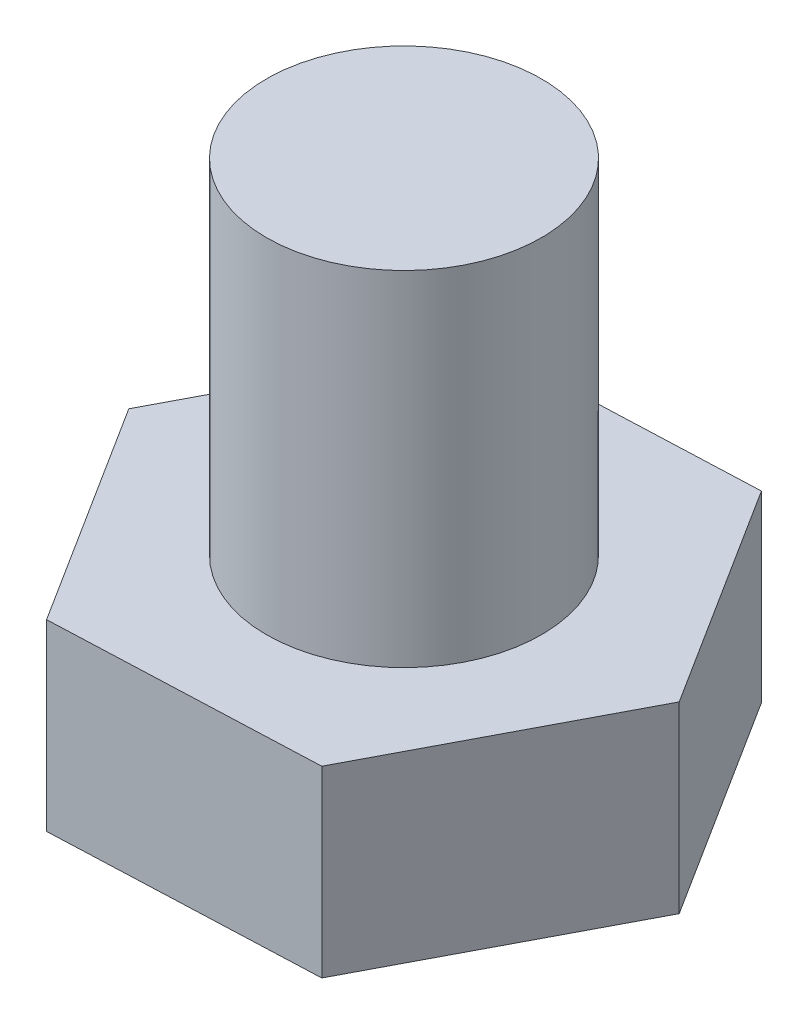
ISO-10303-21;
HEADER;
FILE_DESCRIPTION(('STEP AP214'),'2;1');
FILE_NAME('part.step','',(''),(''),'','','');
FILE_SCHEMA(('AUTOMOTIVE_DESIGN { 1 0 10303 214 1 1 1 1 }'));
ENDSEC;
DATA;
#1=APPLICATION_CONTEXT('core data for automotive mechanical design processes');
#2=APPLICATION_PROTOCOL_DEFINITION('international standard','automotive_design',2000,#1);
#3=PRODUCT_CONTEXT('',#1,'mechanical');
#4=PRODUCT('Part','Part','',(#3));
#5=PRODUCT_RELATED_PRODUCT_CATEGORY('part','',(#4));
#6=PRODUCT_DEFINITION_FORMATION('','',#4);
#7=PRODUCT_DEFINITION_CONTEXT('part definition',#1,'design');
#8=PRODUCT_DEFINITION('design','',#6,#7);
#9=PRODUCT_DEFINITION_SHAPE('','',#8);
#10=(LENGTH_UNIT() NAMED_UNIT(*) SI_UNIT(.MILLI.,.METRE.));
#11=(NAMED_UNIT(*) PLANE_ANGLE_UNIT() SI_UNIT($,.RADIAN.));
#12=(NAMED_UNIT(*) SI_UNIT($,.STERADIAN.) SOLID_ANGLE_UNIT());
#13=UNCERTAINTY_MEASURE_WITH_UNIT(LENGTH_MEASURE(1.E-05),#10,'distance_accuracy_value','');
#14=(GEOMETRIC_REPRESENTATION_CONTEXT(3) GLOBAL_UNCERTAINTY_ASSIGNED_CONTEXT((#13)) GLOBAL_UNIT_ASSIGNED_CONTEXT((#10,
#11,#12)) REPRESENTATION_CONTEXT('',''));
#15=CARTESIAN_POINT('',(0.,0.,0.));
#16=DIRECTION('',(0.,0.,1.));
#17=DIRECTION('',(1.,0.,0.));
#18=AXIS2_PLACEMENT_3D('',#15,#16,#17);
#19=CARTESIAN_POINT('',(11.5376018604348,8.,-0.465914845680283));
#20=DIRECTION('',(-0.845145434914637,0.,0.534536428920377));
#21=DIRECTION('',(0.534536428920377,0.,0.845145434914637));
#22=AXIS2_PLACEMENT_3D('',#19,#20,#21);
#23=PLANE('',#22);
#24=DIRECTION('',(-0.534536428920377,0.,-0.845145434914637));
#25=VECTOR('',#24,1.);
#26=CARTESIAN_POINT('',(11.5376018604348,0.,-0.465914845680283));
#27=LINE('',#26,#25);
#28=CARTESIAN_POINT('',(11.5376018604348,0.,-0.465914845680283));
#29=VERTEX_POINT('',#28);
#30=CARTESIAN_POINT('',(5.36530683785796,0.,-10.2248137327273));
#31=VERTEX_POINT('',#30);
#32=EDGE_CURVE('E119',#29,#31,#27,.T.);
#33=ORIENTED_EDGE('',*,*,#32,.T.);
#34=DIRECTION('',(0.,-1.,0.));
#35=VECTOR('',#34,1.);
#36=CARTESIAN_POINT('',(5.36530683785796,8.,-10.2248137327273));
#37=LINE('',#36,#35);
#38=CARTESIAN_POINT('',(5.36530683785796,8.,-10.2248137327273));
#39=VERTEX_POINT('',#38);
#40=EDGE_CURVE('E36',#39,#31,#37,.T.);
#41=ORIENTED_EDGE('',*,*,#40,.F.);
#42=DIRECTION('',(-0.534536428920377,0.,-0.845145434914637));
#43=VECTOR('',#42,1.);
#44=CARTESIAN_POINT('',(11.5376018604348,8.,-0.465914845680283));
#45=LINE('',#44,#43);
#46=CARTESIAN_POINT('',(11.5376018604348,8.,-0.465914845680283));
#47=VERTEX_POINT('',#46);
#48=EDGE_CURVE('E130',#47,#39,#45,.T.);
#49=ORIENTED_EDGE('',*,*,#48,.F.);
#50=DIRECTION('',(0.,-1.,0.));
#51=VECTOR('',#50,1.);
#52=CARTESIAN_POINT('',(11.5376018604348,8.,-0.465914845680283));
#53=LINE('',#52,#51);
#54=EDGE_CURVE('E115',#47,#29,#53,.T.);
#55=ORIENTED_EDGE('',*,*,#54,.T.);
#56=EDGE_LOOP('',(#33,#41,#49,#55));
#57=FACE_BOUND('',#56,.T.);
#58=ADVANCED_FACE('F33',(#57),#23,.F.);
#59=CARTESIAN_POINT('',(5.36530683785796,8.,-10.2248137327273));
#60=DIRECTION('',(0.0403494092359428,0.,0.999185630988712));
#61=DIRECTION('',(0.999185630988712,0.,-0.0403494092359428));
#62=AXIS2_PLACEMENT_3D('',#59,#60,#61);
#63=PLANE('',#62);
#64=DIRECTION('',(-0.999185630988712,0.,0.0403494092359428));
#65=VECTOR('',#64,1.);
#66=CARTESIAN_POINT('',(5.36530683785796,0.,-10.2248137327273));
#67=LINE('',#66,#65);
#68=CARTESIAN_POINT('',(-6.17229502257682,0.,-9.75889888704698));
#69=VERTEX_POINT('',#68);
#70=EDGE_CURVE('E122',#31,#69,#67,.T.);
#71=ORIENTED_EDGE('',*,*,#70,.T.);
#72=DIRECTION('',(0.,-1.,0.));
#73=VECTOR('',#72,1.);
#74=CARTESIAN_POINT('',(-6.17229502257682,8.,-9.75889888704698));
#75=LINE('',#74,#73);
#76=CARTESIAN_POINT('',(-6.17229502257682,8.,-9.75889888704698));
#77=VERTEX_POINT('',#76);
#78=EDGE_CURVE('E133',#77,#69,#75,.T.);
#79=ORIENTED_EDGE('',*,*,#78,.F.);
#80=DIRECTION('',(-0.999185630988712,0.,0.0403494092359428));
#81=VECTOR('',#80,1.);
#82=CARTESIAN_POINT('',(5.36530683785796,8.,-10.2248137327273));
#83=LINE('',#82,#81);
#84=EDGE_CURVE('E88',#39,#77,#83,.T.);
#85=ORIENTED_EDGE('',*,*,#84,.F.);
#86=ORIENTED_EDGE('',*,*,#40,.T.);
#87=EDGE_LOOP('',(#71,#79,#85,#86));
#88=FACE_BOUND('',#87,.T.);
#89=ADVANCED_FACE('F138',(#88),#63,.F.);
#90=CARTESIAN_POINT('',(-6.17229502257682,8.,-9.75889888704698));
#91=DIRECTION('',(0.88549484415058,0.,0.464649202068335));
#92=DIRECTION('',(0.464649202068335,0.,-0.88549484415058));
#93=AXIS2_PLACEMENT_3D('',#90,#91,#92);
#94=PLANE('',#93);
#95=DIRECTION('',(-0.464649202068335,0.,0.88549484415058));
#96=VECTOR('',#95,1.);
#97=CARTESIAN_POINT('',(-6.17229502257682,0.,-9.75889888704698));
#98=LINE('',#97,#96);
#99=CARTESIAN_POINT('',(-11.5376018604348,0.,0.46591484568028));
#100=VERTEX_POINT('',#99);
#101=EDGE_CURVE('E125',#69,#100,#98,.T.);
#102=ORIENTED_EDGE('',*,*,#101,.T.);
#103=DIRECTION('',(0.,-1.,0.));
#104=VECTOR('',#103,1.);
#105=CARTESIAN_POINT('',(-11.5376018604348,8.,0.46591484568028));
#106=LINE('',#105,#104);
#107=CARTESIAN_POINT('',(-11.5376018604348,8.,0.46591484568028));
#108=VERTEX_POINT('',#107);
#109=EDGE_CURVE('E110',#108,#100,#106,.T.);
#110=ORIENTED_EDGE('',*,*,#109,.F.);
#111=DIRECTION('',(-0.464649202068335,0.,0.88549484415058));
#112=VECTOR('',#111,1.);
#113=CARTESIAN_POINT('',(-6.17229502257682,8.,-9.75889888704698));
#114=LINE('',#113,#112);
#115=EDGE_CURVE('E101',#77,#108,#114,.T.);
#116=ORIENTED_EDGE('',*,*,#115,.F.);
#117=ORIENTED_EDGE('',*,*,#78,.T.);
#118=EDGE_LOOP('',(#102,#110,#116,#117));
#119=FACE_BOUND('',#118,.T.);
#120=ADVANCED_FACE('F144',(#119),#94,.F.);
#121=CARTESIAN_POINT('',(-11.5376018604348,8.,0.46591484568028));
#122=DIRECTION('',(0.845145434914637,0.,-0.534536428920377));
#123=DIRECTION('',(-0.534536428920377,0.,-0.845145434914637));
#124=AXIS2_PLACEMENT_3D('',#121,#122,#123);
#125=PLANE('',#124);
#126=DIRECTION('',(0.534536428920377,0.,0.845145434914637));
#127=VECTOR('',#126,1.);
#128=CARTESIAN_POINT('',(-11.5376018604348,0.,0.46591484568028));
#129=LINE('',#128,#127);
#130=CARTESIAN_POINT('',(-5.36530683785796,0.,10.2248137327273));
#131=VERTEX_POINT('',#130);
#132=EDGE_CURVE('E109',#100,#131,#129,.T.);
#133=ORIENTED_EDGE('',*,*,#132,.T.);
#134=DIRECTION('',(0.,-1.,0.));
#135=VECTOR('',#134,1.);
#136=CARTESIAN_POINT('',(-5.36530683785796,8.,10.2248137327273));
#137=LINE('',#136,#135);
#138=CARTESIAN_POINT('',(-5.36530683785796,8.,10.2248137327273));
#139=VERTEX_POINT('',#138);
#140=EDGE_CURVE('E106',#139,#131,#137,.T.);
#141=ORIENTED_EDGE('',*,*,#140,.F.);
#142=DIRECTION('',(0.534536428920377,0.,0.845145434914637));
#143=VECTOR('',#142,1.);
#144=CARTESIAN_POINT('',(-11.5376018604348,8.,0.46591484568028));
#145=LINE('',#144,#143);
#146=EDGE_CURVE('E95',#108,#139,#145,.T.);
#147=ORIENTED_EDGE('',*,*,#146,.F.);
#148=ORIENTED_EDGE('',*,*,#109,.T.);
#149=EDGE_LOOP('',(#133,#141,#147,#148));
#150=FACE_BOUND('',#149,.T.);
#151=ADVANCED_FACE('F107',(#150),#125,.F.);
#152=CARTESIAN_POINT('',(-5.36530683785796,8.,10.2248137327273));
#153=DIRECTION('',(-0.040349409235943,0.,-0.999185630988712));
#154=DIRECTION('',(-0.999185630988712,0.,0.0403494092359429));
#155=AXIS2_PLACEMENT_3D('',#152,#153,#154);
#156=PLANE('',#155);
#157=DIRECTION('',(0.999185630988712,0.,-0.0403494092359429));
#158=VECTOR('',#157,1.);
#159=CARTESIAN_POINT('',(-5.36530683785796,0.,10.2248137327273));
#160=LINE('',#159,#158);
#161=CARTESIAN_POINT('',(6.17229502257682,0.,9.75889888704698));
#162=VERTEX_POINT('',#161);
#163=EDGE_CURVE('E73',#131,#162,#160,.T.);
#164=ORIENTED_EDGE('',*,*,#163,.T.);
#165=DIRECTION('',(0.,-1.,0.));
#166=VECTOR('',#165,1.);
#167=CARTESIAN_POINT('',(6.17229502257682,8.,9.75889888704698));
#168=LINE('',#167,#166);
#169=CARTESIAN_POINT('',(6.17229502257682,8.,9.75889888704698));
#170=VERTEX_POINT('',#169);
#171=EDGE_CURVE('E111',#170,#162,#168,.T.);
#172=ORIENTED_EDGE('',*,*,#171,.F.);
#173=DIRECTION('',(0.999185630988712,0.,-0.0403494092359429));
#174=VECTOR('',#173,1.);
#175=CARTESIAN_POINT('',(-5.36530683785796,8.,10.2248137327273));
#176=LINE('',#175,#174);
#177=EDGE_CURVE('E99',#139,#170,#176,.T.);
#178=ORIENTED_EDGE('',*,*,#177,.F.);
#179=ORIENTED_EDGE('',*,*,#140,.T.);
#180=EDGE_LOOP('',(#164,#172,#178,#179));
#181=FACE_BOUND('',#180,.T.);
#182=ADVANCED_FACE('F113',(#181),#156,.F.);
#183=CARTESIAN_POINT('',(6.17229502257682,8.,9.75889888704698));
#184=DIRECTION('',(-0.88549484415058,0.,-0.464649202068335));
#185=DIRECTION('',(-0.464649202068335,0.,0.88549484415058));
#186=AXIS2_PLACEMENT_3D('',#183,#184,#185);
#187=PLANE('',#186);
#188=DIRECTION('',(0.464649202068335,0.,-0.88549484415058));
#189=VECTOR('',#188,1.);
#190=CARTESIAN_POINT('',(6.17229502257682,0.,9.75889888704698));
#191=LINE('',#190,#189);
#192=EDGE_CURVE('E79',#162,#29,#191,.T.);
#193=ORIENTED_EDGE('',*,*,#192,.T.);
#194=ORIENTED_EDGE('',*,*,#54,.F.);
#195=DIRECTION('',(0.464649202068335,0.,-0.88549484415058));
#196=VECTOR('',#195,1.);
#197=CARTESIAN_POINT('',(6.17229502257682,8.,9.75889888704698));
#198=LINE('',#197,#196);
#199=EDGE_CURVE('E50',#170,#47,#198,.T.);
#200=ORIENTED_EDGE('',*,*,#199,.F.);
#201=ORIENTED_EDGE('',*,*,#171,.T.);
#202=EDGE_LOOP('',(#193,#194,#200,#201));
#203=FACE_BOUND('',#202,.T.);
#204=ADVANCED_FACE('F160',(#203),#187,.F.);
#205=CARTESIAN_POINT('',(0.,8.,0.));
#206=DIRECTION('',(0.,1.,0.));
#207=DIRECTION('',(0.,0.,1.));
#208=AXIS2_PLACEMENT_3D('',#205,#206,#207);
#209=PLANE('',#208);
#210=CARTESIAN_POINT('',(0.,8.,0.));
#211=DIRECTION('',(0.,1.,0.));
#212=DIRECTION('',(0.,0.,1.));
#213=AXIS2_PLACEMENT_3D('',#210,#211,#212);
#214=CIRCLE('',#213,6.);
#215=CARTESIAN_POINT('',(0.,8.,6.));
#216=VERTEX_POINT('',#215);
#217=EDGE_CURVE('E11',#216,#216,#214,.T.);
#218=ORIENTED_EDGE('',*,*,#217,.F.);
#219=EDGE_LOOP('',(#218));
#220=FACE_BOUND('',#219,.T.);
#221=ORIENTED_EDGE('',*,*,#48,.T.);
#222=ORIENTED_EDGE('',*,*,#84,.T.);
#223=ORIENTED_EDGE('',*,*,#115,.T.);
#224=ORIENTED_EDGE('',*,*,#146,.T.);
#225=ORIENTED_EDGE('',*,*,#177,.T.);
#226=ORIENTED_EDGE('',*,*,#199,.T.);
#227=EDGE_LOOP('',(#221,#222,#223,#224,#225,#226));
#228=FACE_BOUND('',#227,.T.);
#229=ADVANCED_FACE('F97',(#220,#228),#209,.T.);
#230=CARTESIAN_POINT('',(0.,0.,0.));
#231=DIRECTION('',(0.,1.,0.));
#232=DIRECTION('',(0.,0.,1.));
#233=AXIS2_PLACEMENT_3D('',#230,#231,#232);
#234=PLANE('',#233);
#235=ORIENTED_EDGE('',*,*,#32,.F.);
#236=ORIENTED_EDGE('',*,*,#192,.F.);
#237=ORIENTED_EDGE('',*,*,#163,.F.);
#238=ORIENTED_EDGE('',*,*,#132,.F.);
#239=ORIENTED_EDGE('',*,*,#101,.F.);
#240=ORIENTED_EDGE('',*,*,#70,.F.);
#241=EDGE_LOOP('',(#235,#236,#237,#238,#239,#240));
#242=FACE_BOUND('',#241,.T.);
#243=ADVANCED_FACE('F143',(#242),#234,.F.);
#244=CARTESIAN_POINT('',(0.,23.,0.));
#245=DIRECTION('',(0.,-1.,0.));
#246=DIRECTION('',(0.,0.,-1.));
#247=AXIS2_PLACEMENT_3D('',#244,#245,#246);
#248=CYLINDRICAL_SURFACE('',#247,6.);
#249=CARTESIAN_POINT('',(0.,23.,0.));
#250=DIRECTION('',(0.,1.,0.));
#251=DIRECTION('',(0.,0.,1.));
#252=AXIS2_PLACEMENT_3D('',#249,#250,#251);
#253=CIRCLE('',#252,6.);
#254=CARTESIAN_POINT('',(0.,23.,6.));
#255=VERTEX_POINT('',#254);
#256=EDGE_CURVE('E123',#255,#255,#253,.T.);
#257=ORIENTED_EDGE('',*,*,#256,.F.);
#258=EDGE_LOOP('',(#257));
#259=FACE_BOUND('',#258,.T.);
#260=ORIENTED_EDGE('',*,*,#217,.T.);
#261=EDGE_LOOP('',(#260));
#262=FACE_BOUND('',#261,.T.);
#263=ADVANCED_FACE('F153',(#259,#262),#248,.T.);
#264=CARTESIAN_POINT('',(0.,23.,0.));
#265=DIRECTION('',(0.,1.,0.));
#266=DIRECTION('',(0.,0.,1.));
#267=AXIS2_PLACEMENT_3D('',#264,#265,#266);
#268=PLANE('',#267);
#269=ORIENTED_EDGE('',*,*,#256,.T.);
#270=EDGE_LOOP('',(#269));
#271=FACE_BOUND('',#270,.T.);
#272=ADVANCED_FACE('F151',(#271),#268,.T.);
#273=CLOSED_SHELL('',(#58,#89,#120,#151,#182,#204,#229,#243,#263,#272));
#274=MANIFOLD_SOLID_BREP('B2',#273);
#275=ADVANCED_BREP_SHAPE_REPRESENTATION('',(#18,#274),#14);
#276=SHAPE_DEFINITION_REPRESENTATION(#9,#275);
ENDSEC;
END-ISO-10303-21;
